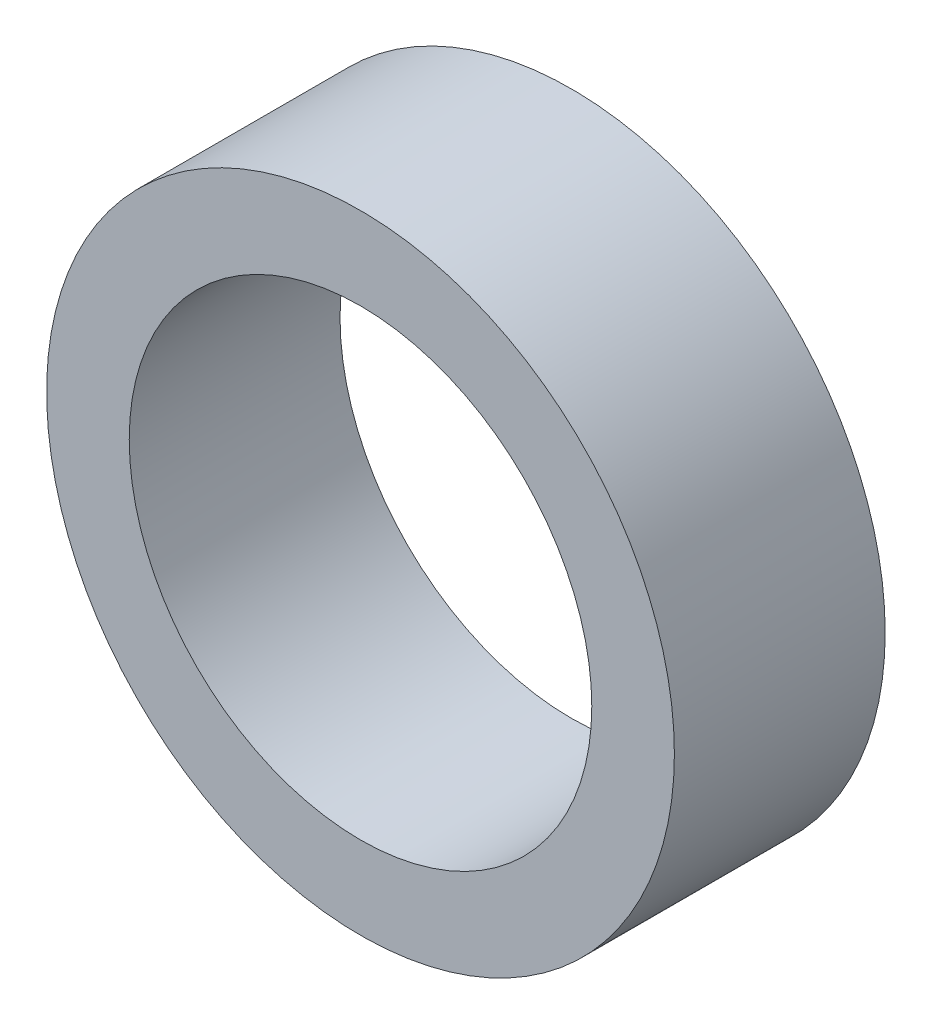
ISO-10303-21;
HEADER;
FILE_DESCRIPTION(('STEP AP214'),'2;1');
FILE_NAME('part.step','',(''),(''),'','','');
FILE_SCHEMA(('AUTOMOTIVE_DESIGN { 1 0 10303 214 1 1 1 1 }'));
ENDSEC;
DATA;
#1=APPLICATION_CONTEXT('core data for automotive mechanical design processes');
#2=APPLICATION_PROTOCOL_DEFINITION('international standard','automotive_design',2000,#1);
#3=PRODUCT_CONTEXT('',#1,'mechanical');
#4=PRODUCT('Part','Part','',(#3));
#5=PRODUCT_RELATED_PRODUCT_CATEGORY('part','',(#4));
#6=PRODUCT_DEFINITION_FORMATION('','',#4);
#7=PRODUCT_DEFINITION_CONTEXT('part definition',#1,'design');
#8=PRODUCT_DEFINITION('design','',#6,#7);
#9=PRODUCT_DEFINITION_SHAPE('','',#8);
#10=(LENGTH_UNIT() NAMED_UNIT(*) SI_UNIT(.MILLI.,.METRE.));
#11=(NAMED_UNIT(*) PLANE_ANGLE_UNIT() SI_UNIT($,.RADIAN.));
#12=(NAMED_UNIT(*) SI_UNIT($,.STERADIAN.) SOLID_ANGLE_UNIT());
#13=UNCERTAINTY_MEASURE_WITH_UNIT(LENGTH_MEASURE(1.E-05),#10,'distance_accuracy_value','');
#14=(GEOMETRIC_REPRESENTATION_CONTEXT(3) GLOBAL_UNCERTAINTY_ASSIGNED_CONTEXT((#13)) GLOBAL_UNIT_ASSIGNED_CONTEXT((#10,
#11,#12)) REPRESENTATION_CONTEXT('',''));
#15=CARTESIAN_POINT('',(0.,0.,0.));
#16=DIRECTION('',(0.,0.,1.));
#17=DIRECTION('',(1.,0.,0.));
#18=AXIS2_PLACEMENT_3D('',#15,#16,#17);
#19=CARTESIAN_POINT('',(0.,0.,3.24104));
#20=DIRECTION('',(0.,0.,1.));
#21=DIRECTION('',(1.,0.,0.));
#22=AXIS2_PLACEMENT_3D('',#19,#20,#21);
#23=PLANE('',#22);
#24=CARTESIAN_POINT('',(0.,0.,3.24104));
#25=DIRECTION('',(0.,0.,1.));
#26=DIRECTION('',(1.,0.,0.));
#27=AXIS2_PLACEMENT_3D('',#24,#25,#26);
#28=CIRCLE('',#27,4.826);
#29=CARTESIAN_POINT('',(4.826,0.,3.24104));
#30=VERTEX_POINT('',#29);
#31=EDGE_CURVE('E10',#30,#30,#28,.T.);
#32=ORIENTED_EDGE('',*,*,#31,.T.);
#33=EDGE_LOOP('',(#32));
#34=FACE_BOUND('',#33,.T.);
#35=CARTESIAN_POINT('',(0.,0.,3.24104));
#36=DIRECTION('',(0.,0.,1.));
#37=DIRECTION('',(1.,0.,0.));
#38=AXIS2_PLACEMENT_3D('',#35,#36,#37);
#39=CIRCLE('',#38,3.556);
#40=CARTESIAN_POINT('',(3.556,0.,3.24104));
#41=VERTEX_POINT('',#40);
#42=EDGE_CURVE('E42',#41,#41,#39,.T.);
#43=ORIENTED_EDGE('',*,*,#42,.F.);
#44=EDGE_LOOP('',(#43));
#45=FACE_BOUND('',#44,.T.);
#46=ADVANCED_FACE('F31',(#34,#45),#23,.T.);
#47=CARTESIAN_POINT('',(0.,0.,0.));
#48=DIRECTION('',(0.,0.,1.));
#49=DIRECTION('',(1.,0.,0.));
#50=AXIS2_PLACEMENT_3D('',#47,#48,#49);
#51=PLANE('',#50);
#52=CARTESIAN_POINT('',(0.,0.,0.));
#53=DIRECTION('',(0.,0.,1.));
#54=DIRECTION('',(1.,0.,0.));
#55=AXIS2_PLACEMENT_3D('',#52,#53,#54);
#56=CIRCLE('',#55,4.826);
#57=CARTESIAN_POINT('',(4.826,0.,0.));
#58=VERTEX_POINT('',#57);
#59=EDGE_CURVE('E35',#58,#58,#56,.T.);
#60=ORIENTED_EDGE('',*,*,#59,.F.);
#61=EDGE_LOOP('',(#60));
#62=FACE_BOUND('',#61,.T.);
#63=CARTESIAN_POINT('',(0.,0.,0.));
#64=DIRECTION('',(0.,0.,1.));
#65=DIRECTION('',(1.,0.,0.));
#66=AXIS2_PLACEMENT_3D('',#63,#64,#65);
#67=CIRCLE('',#66,3.556);
#68=CARTESIAN_POINT('',(3.556,0.,0.));
#69=VERTEX_POINT('',#68);
#70=EDGE_CURVE('E44',#69,#69,#67,.T.);
#71=ORIENTED_EDGE('',*,*,#70,.T.);
#72=EDGE_LOOP('',(#71));
#73=FACE_BOUND('',#72,.T.);
#74=ADVANCED_FACE('F54',(#62,#73),#51,.F.);
#75=CARTESIAN_POINT('',(0.,0.,3.24104));
#76=DIRECTION('',(0.,0.,-1.));
#77=DIRECTION('',(-1.,0.,0.));
#78=AXIS2_PLACEMENT_3D('',#75,#76,#77);
#79=CYLINDRICAL_SURFACE('',#78,4.826);
#80=ORIENTED_EDGE('',*,*,#31,.F.);
#81=EDGE_LOOP('',(#80));
#82=FACE_BOUND('',#81,.T.);
#83=ORIENTED_EDGE('',*,*,#59,.T.);
#84=EDGE_LOOP('',(#83));
#85=FACE_BOUND('',#84,.T.);
#86=ADVANCED_FACE('F33',(#82,#85),#79,.T.);
#87=CARTESIAN_POINT('',(0.,0.,3.24104));
#88=DIRECTION('',(0.,0.,-1.));
#89=DIRECTION('',(-1.,0.,0.));
#90=AXIS2_PLACEMENT_3D('',#87,#88,#89);
#91=CYLINDRICAL_SURFACE('',#90,3.556);
#92=ORIENTED_EDGE('',*,*,#42,.T.);
#93=EDGE_LOOP('',(#92));
#94=FACE_BOUND('',#93,.T.);
#95=ORIENTED_EDGE('',*,*,#70,.F.);
#96=EDGE_LOOP('',(#95));
#97=FACE_BOUND('',#96,.T.);
#98=ADVANCED_FACE('F50',(#94,#97),#91,.F.);
#99=CLOSED_SHELL('',(#46,#74,#86,#98));
#100=MANIFOLD_SOLID_BREP('B2',#99);
#101=ADVANCED_BREP_SHAPE_REPRESENTATION('',(#18,#100),#14);
#102=SHAPE_DEFINITION_REPRESENTATION(#9,#101);
ENDSEC;
END-ISO-10303-21;
